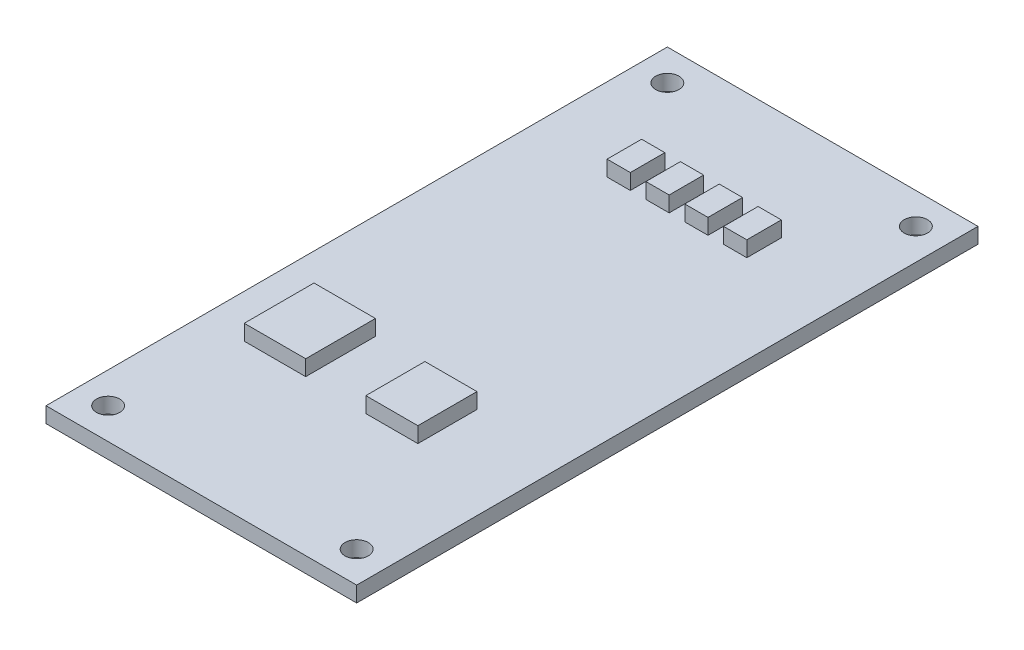
ISO-10303-21;
HEADER;
FILE_DESCRIPTION(('STEP AP214'),'2;1');
FILE_NAME('part.step','',(''),(''),'','','');
FILE_SCHEMA(('AUTOMOTIVE_DESIGN { 1 0 10303 214 1 1 1 1 }'));
ENDSEC;
DATA;
#1=APPLICATION_CONTEXT('core data for automotive mechanical design processes');
#2=APPLICATION_PROTOCOL_DEFINITION('international standard','automotive_design',2000,#1);
#3=PRODUCT_CONTEXT('',#1,'mechanical');
#4=PRODUCT('Part','Part','',(#3));
#5=PRODUCT_RELATED_PRODUCT_CATEGORY('part','',(#4));
#6=PRODUCT_DEFINITION_FORMATION('','',#4);
#7=PRODUCT_DEFINITION_CONTEXT('part definition',#1,'design');
#8=PRODUCT_DEFINITION('design','',#6,#7);
#9=PRODUCT_DEFINITION_SHAPE('','',#8);
#10=(LENGTH_UNIT() NAMED_UNIT(*) SI_UNIT(.MILLI.,.METRE.));
#11=(NAMED_UNIT(*) PLANE_ANGLE_UNIT() SI_UNIT($,.RADIAN.));
#12=(NAMED_UNIT(*) SI_UNIT($,.STERADIAN.) SOLID_ANGLE_UNIT());
#13=UNCERTAINTY_MEASURE_WITH_UNIT(LENGTH_MEASURE(1.E-05),#10,'distance_accuracy_value','');
#14=(GEOMETRIC_REPRESENTATION_CONTEXT(3) GLOBAL_UNCERTAINTY_ASSIGNED_CONTEXT((#13)) GLOBAL_UNIT_ASSIGNED_CONTEXT((#10,
#11,#12)) REPRESENTATION_CONTEXT('',''));
#15=CARTESIAN_POINT('',(0.,0.,0.));
#16=DIRECTION('',(0.,0.,1.));
#17=DIRECTION('',(1.,0.,0.));
#18=AXIS2_PLACEMENT_3D('',#15,#16,#17);
#19=CARTESIAN_POINT('',(0.,2.,0.));
#20=DIRECTION('',(0.,1.,0.));
#21=DIRECTION('',(0.,0.,1.));
#22=AXIS2_PLACEMENT_3D('',#19,#20,#21);
#23=PLANE('',#22);
#24=CARTESIAN_POINT('',(16.0000000000008,2.,36.));
#25=DIRECTION('',(0.,1.,0.));
#26=DIRECTION('',(0.,0.,1.));
#27=AXIS2_PLACEMENT_3D('',#24,#25,#26);
#28=CIRCLE('',#27,1.5);
#29=CARTESIAN_POINT('',(16.0000000000008,2.,37.5));
#30=VERTEX_POINT('',#29);
#31=EDGE_CURVE('E399',#30,#30,#28,.T.);
#32=ORIENTED_EDGE('',*,*,#31,.F.);
#33=EDGE_LOOP('',(#32));
#34=FACE_BOUND('',#33,.T.);
#35=CARTESIAN_POINT('',(-16.,2.,-36.));
#36=DIRECTION('',(0.,1.,0.));
#37=DIRECTION('',(0.,0.,1.));
#38=AXIS2_PLACEMENT_3D('',#35,#36,#37);
#39=CIRCLE('',#38,1.5);
#40=CARTESIAN_POINT('',(-16.,2.,-34.5));
#41=VERTEX_POINT('',#40);
#42=EDGE_CURVE('E411',#41,#41,#39,.T.);
#43=ORIENTED_EDGE('',*,*,#42,.F.);
#44=EDGE_LOOP('',(#43));
#45=FACE_BOUND('',#44,.T.);
#46=DIRECTION('',(0.,0.,1.));
#47=VECTOR('',#46,1.);
#48=CARTESIAN_POINT('',(-20.,2.,40.));
#49=LINE('',#48,#47);
#50=CARTESIAN_POINT('',(-20.,2.,-40.));
#51=VERTEX_POINT('',#50);
#52=CARTESIAN_POINT('',(-20.,2.,40.));
#53=VERTEX_POINT('',#52);
#54=EDGE_CURVE('E417',#51,#53,#49,.T.);
#55=ORIENTED_EDGE('',*,*,#54,.T.);
#56=DIRECTION('',(1.,0.,0.));
#57=VECTOR('',#56,1.);
#58=CARTESIAN_POINT('',(20.,2.,40.));
#59=LINE('',#58,#57);
#60=CARTESIAN_POINT('',(20.,2.,40.));
#61=VERTEX_POINT('',#60);
#62=EDGE_CURVE('E420',#53,#61,#59,.T.);
#63=ORIENTED_EDGE('',*,*,#62,.T.);
#64=DIRECTION('',(0.,0.,-1.));
#65=VECTOR('',#64,1.);
#66=CARTESIAN_POINT('',(20.,2.,40.));
#67=LINE('',#66,#65);
#68=CARTESIAN_POINT('',(20.,2.,-40.));
#69=VERTEX_POINT('',#68);
#70=EDGE_CURVE('E423',#61,#69,#67,.T.);
#71=ORIENTED_EDGE('',*,*,#70,.T.);
#72=DIRECTION('',(-1.,0.,0.));
#73=VECTOR('',#72,1.);
#74=CARTESIAN_POINT('',(20.,2.,-40.));
#75=LINE('',#74,#73);
#76=EDGE_CURVE('E425',#69,#51,#75,.T.);
#77=ORIENTED_EDGE('',*,*,#76,.T.);
#78=EDGE_LOOP('',(#55,#63,#71,#77));
#79=FACE_BOUND('',#78,.T.);
#80=CARTESIAN_POINT('',(16.,2.,-36.));
#81=DIRECTION('',(0.,1.,0.));
#82=DIRECTION('',(0.,0.,1.));
#83=AXIS2_PLACEMENT_3D('',#80,#81,#82);
#84=CIRCLE('',#83,1.5);
#85=CARTESIAN_POINT('',(16.,2.,-34.5));
#86=VERTEX_POINT('',#85);
#87=EDGE_CURVE('E405',#86,#86,#84,.T.);
#88=ORIENTED_EDGE('',*,*,#87,.F.);
#89=EDGE_LOOP('',(#88));
#90=FACE_BOUND('',#89,.T.);
#91=CARTESIAN_POINT('',(-15.9999999999992,2.,36.));
#92=DIRECTION('',(0.,1.,0.));
#93=DIRECTION('',(0.,0.,1.));
#94=AXIS2_PLACEMENT_3D('',#91,#92,#93);
#95=CIRCLE('',#94,1.5);
#96=CARTESIAN_POINT('',(-15.9999999999992,2.,37.5));
#97=VERTEX_POINT('',#96);
#98=EDGE_CURVE('E393',#97,#97,#95,.T.);
#99=ORIENTED_EDGE('',*,*,#98,.F.);
#100=EDGE_LOOP('',(#99));
#101=FACE_BOUND('',#100,.T.);
#102=DIRECTION('',(-1.,0.,0.));
#103=VECTOR('',#102,1.);
#104=CARTESIAN_POINT('',(-14.430267486052,2.,11.0632050726399));
#105=LINE('',#104,#103);
#106=CARTESIAN_POINT('',(-6.52034308629017,2.,11.0632050726399));
#107=VERTEX_POINT('',#106);
#108=CARTESIAN_POINT('',(-14.430267486052,2.,11.0632050726399));
#109=VERTEX_POINT('',#108);
#110=EDGE_CURVE('E377',#107,#109,#105,.T.);
#111=ORIENTED_EDGE('',*,*,#110,.F.);
#112=DIRECTION('',(0.,0.,-1.));
#113=VECTOR('',#112,1.);
#114=CARTESIAN_POINT('',(-6.52034308629017,2.,11.0632050726399));
#115=LINE('',#114,#113);
#116=CARTESIAN_POINT('',(-6.52034308629017,2.,20.0420381750722));
#117=VERTEX_POINT('',#116);
#118=EDGE_CURVE('E363',#117,#107,#115,.T.);
#119=ORIENTED_EDGE('',*,*,#118,.F.);
#120=DIRECTION('',(1.,0.,0.));
#121=VECTOR('',#120,1.);
#122=CARTESIAN_POINT('',(-14.430267486052,2.,20.0420381750722));
#123=LINE('',#122,#121);
#124=CARTESIAN_POINT('',(-14.430267486052,2.,20.0420381750722));
#125=VERTEX_POINT('',#124);
#126=EDGE_CURVE('E368',#125,#117,#123,.T.);
#127=ORIENTED_EDGE('',*,*,#126,.F.);
#128=DIRECTION('',(0.,0.,1.));
#129=VECTOR('',#128,1.);
#130=CARTESIAN_POINT('',(-14.430267486052,2.,11.0632050726399));
#131=LINE('',#130,#129);
#132=EDGE_CURVE('E379',#109,#125,#131,.T.);
#133=ORIENTED_EDGE('',*,*,#132,.F.);
#134=EDGE_LOOP('',(#111,#119,#127,#133));
#135=FACE_BOUND('',#134,.T.);
#136=DIRECTION('',(-1.,0.,0.));
#137=VECTOR('',#136,1.);
#138=CARTESIAN_POINT('',(1.46490476535392,2.,12.6783234692352));
#139=LINE('',#138,#137);
#140=CARTESIAN_POINT('',(8.16668323767724,2.,12.6783234692352));
#141=VERTEX_POINT('',#140);
#142=CARTESIAN_POINT('',(1.46490476535392,2.,12.6783234692352));
#143=VERTEX_POINT('',#142);
#144=EDGE_CURVE('E348',#141,#143,#139,.T.);
#145=ORIENTED_EDGE('',*,*,#144,.F.);
#146=DIRECTION('',(0.,0.,-1.));
#147=VECTOR('',#146,1.);
#148=CARTESIAN_POINT('',(8.16668323767724,2.,12.6783234692352));
#149=LINE('',#148,#147);
#150=CARTESIAN_POINT('',(8.16668323767724,2.,20.2857476810617));
#151=VERTEX_POINT('',#150);
#152=EDGE_CURVE('E334',#151,#141,#149,.T.);
#153=ORIENTED_EDGE('',*,*,#152,.F.);
#154=DIRECTION('',(1.,0.,0.));
#155=VECTOR('',#154,1.);
#156=CARTESIAN_POINT('',(1.46490476535392,2.,20.2857476810617));
#157=LINE('',#156,#155);
#158=CARTESIAN_POINT('',(1.46490476535392,2.,20.2857476810617));
#159=VERTEX_POINT('',#158);
#160=EDGE_CURVE('E339',#159,#151,#157,.T.);
#161=ORIENTED_EDGE('',*,*,#160,.F.);
#162=DIRECTION('',(0.,0.,1.));
#163=VECTOR('',#162,1.);
#164=CARTESIAN_POINT('',(1.46490476535392,2.,12.6783234692352));
#165=LINE('',#164,#163);
#166=EDGE_CURVE('E350',#143,#159,#165,.T.);
#167=ORIENTED_EDGE('',*,*,#166,.F.);
#168=EDGE_LOOP('',(#145,#153,#161,#167));
#169=FACE_BOUND('',#168,.T.);
#170=DIRECTION('',(-1.,0.,0.));
#171=VECTOR('',#170,1.);
#172=CARTESIAN_POINT('',(-9.37411141019778,2.,-26.0600449276688));
#173=LINE('',#172,#171);
#174=CARTESIAN_POINT('',(-6.38247865006747,2.,-26.0600449276688));
#175=VERTEX_POINT('',#174);
#176=CARTESIAN_POINT('',(-9.37411141019778,2.,-26.0600449276688));
#177=VERTEX_POINT('',#176);
#178=EDGE_CURVE('E319',#175,#177,#173,.T.);
#179=ORIENTED_EDGE('',*,*,#178,.F.);
#180=DIRECTION('',(0.,0.,-1.));
#181=VECTOR('',#180,1.);
#182=CARTESIAN_POINT('',(-6.38247865006747,2.,-26.0600449276688));
#183=LINE('',#182,#181);
#184=CARTESIAN_POINT('',(-6.38247865006747,2.,-21.6175192445576));
#185=VERTEX_POINT('',#184);
#186=EDGE_CURVE('E305',#185,#175,#183,.T.);
#187=ORIENTED_EDGE('',*,*,#186,.F.);
#188=DIRECTION('',(1.,0.,0.));
#189=VECTOR('',#188,1.);
#190=CARTESIAN_POINT('',(-9.37411141019778,2.,-21.6175192445576));
#191=LINE('',#190,#189);
#192=CARTESIAN_POINT('',(-9.37411141019778,2.,-21.6175192445576));
#193=VERTEX_POINT('',#192);
#194=EDGE_CURVE('E310',#193,#185,#191,.T.);
#195=ORIENTED_EDGE('',*,*,#194,.F.);
#196=DIRECTION('',(0.,0.,1.));
#197=VECTOR('',#196,1.);
#198=CARTESIAN_POINT('',(-9.37411141019778,2.,-26.0600449276688));
#199=LINE('',#198,#197);
#200=EDGE_CURVE('E321',#177,#193,#199,.T.);
#201=ORIENTED_EDGE('',*,*,#200,.F.);
#202=EDGE_LOOP('',(#179,#187,#195,#201));
#203=FACE_BOUND('',#202,.T.);
#204=DIRECTION('',(-1.,0.,0.));
#205=VECTOR('',#204,1.);
#206=CARTESIAN_POINT('',(-4.37411141019778,2.,-26.0600449276688));
#207=LINE('',#206,#205);
#208=CARTESIAN_POINT('',(-1.38247865006747,2.,-26.0600449276688));
#209=VERTEX_POINT('',#208);
#210=CARTESIAN_POINT('',(-4.37411141019778,2.,-26.0600449276688));
#211=VERTEX_POINT('',#210);
#212=EDGE_CURVE('E290',#209,#211,#207,.T.);
#213=ORIENTED_EDGE('',*,*,#212,.F.);
#214=DIRECTION('',(0.,0.,-1.));
#215=VECTOR('',#214,1.);
#216=CARTESIAN_POINT('',(-1.38247865006747,2.,-26.0600449276688));
#217=LINE('',#216,#215);
#218=CARTESIAN_POINT('',(-1.38247865006747,2.,-21.6175192445576));
#219=VERTEX_POINT('',#218);
#220=EDGE_CURVE('E276',#219,#209,#217,.T.);
#221=ORIENTED_EDGE('',*,*,#220,.F.);
#222=DIRECTION('',(1.,0.,0.));
#223=VECTOR('',#222,1.);
#224=CARTESIAN_POINT('',(-4.37411141019778,2.,-21.6175192445576));
#225=LINE('',#224,#223);
#226=CARTESIAN_POINT('',(-4.37411141019778,2.,-21.6175192445576));
#227=VERTEX_POINT('',#226);
#228=EDGE_CURVE('E281',#227,#219,#225,.T.);
#229=ORIENTED_EDGE('',*,*,#228,.F.);
#230=DIRECTION('',(0.,0.,1.));
#231=VECTOR('',#230,1.);
#232=CARTESIAN_POINT('',(-4.37411141019778,2.,-26.0600449276688));
#233=LINE('',#232,#231);
#234=EDGE_CURVE('E292',#211,#227,#233,.T.);
#235=ORIENTED_EDGE('',*,*,#234,.F.);
#236=EDGE_LOOP('',(#213,#221,#229,#235));
#237=FACE_BOUND('',#236,.T.);
#238=DIRECTION('',(-1.,0.,0.));
#239=VECTOR('',#238,1.);
#240=CARTESIAN_POINT('',(0.625888589802217,2.,-26.0600449276688));
#241=LINE('',#240,#239);
#242=CARTESIAN_POINT('',(3.61752134993253,2.,-26.0600449276688));
#243=VERTEX_POINT('',#242);
#244=CARTESIAN_POINT('',(0.625888589802217,2.,-26.0600449276688));
#245=VERTEX_POINT('',#244);
#246=EDGE_CURVE('E248',#243,#245,#241,.T.);
#247=ORIENTED_EDGE('',*,*,#246,.F.);
#248=DIRECTION('',(0.,0.,-1.));
#249=VECTOR('',#248,1.);
#250=CARTESIAN_POINT('',(3.61752134993253,2.,-26.0600449276688));
#251=LINE('',#250,#249);
#252=CARTESIAN_POINT('',(3.61752134993253,2.,-21.6175192445576));
#253=VERTEX_POINT('',#252);
#254=EDGE_CURVE('E245',#253,#243,#251,.T.);
#255=ORIENTED_EDGE('',*,*,#254,.F.);
#256=DIRECTION('',(1.,0.,0.));
#257=VECTOR('',#256,1.);
#258=CARTESIAN_POINT('',(0.625888589802217,2.,-21.6175192445576));
#259=LINE('',#258,#257);
#260=CARTESIAN_POINT('',(0.625888589802217,2.,-21.6175192445576));
#261=VERTEX_POINT('',#260);
#262=EDGE_CURVE('E257',#261,#253,#259,.T.);
#263=ORIENTED_EDGE('',*,*,#262,.F.);
#264=DIRECTION('',(0.,0.,1.));
#265=VECTOR('',#264,1.);
#266=CARTESIAN_POINT('',(0.625888589802217,2.,-26.0600449276688));
#267=LINE('',#266,#265);
#268=EDGE_CURVE('E265',#245,#261,#267,.T.);
#269=ORIENTED_EDGE('',*,*,#268,.F.);
#270=EDGE_LOOP('',(#247,#255,#263,#269));
#271=FACE_BOUND('',#270,.T.);
#272=DIRECTION('',(-1.,0.,0.));
#273=VECTOR('',#272,1.);
#274=CARTESIAN_POINT('',(5.62588858980222,2.,-26.0600449276688));
#275=LINE('',#274,#273);
#276=CARTESIAN_POINT('',(8.61752134993253,2.,-26.0600449276688));
#277=VERTEX_POINT('',#276);
#278=CARTESIAN_POINT('',(5.62588858980222,2.,-26.0600449276688));
#279=VERTEX_POINT('',#278);
#280=EDGE_CURVE('E860',#277,#279,#275,.T.);
#281=ORIENTED_EDGE('',*,*,#280,.F.);
#282=DIRECTION('',(0.,0.,-1.));
#283=VECTOR('',#282,1.);
#284=CARTESIAN_POINT('',(8.61752134993253,2.,-26.0600449276688));
#285=LINE('',#284,#283);
#286=CARTESIAN_POINT('',(8.61752134993253,2.,-21.6175192445576));
#287=VERTEX_POINT('',#286);
#288=EDGE_CURVE('E243',#287,#277,#285,.T.);
#289=ORIENTED_EDGE('',*,*,#288,.F.);
#290=DIRECTION('',(1.,0.,0.));
#291=VECTOR('',#290,1.);
#292=CARTESIAN_POINT('',(5.62588858980222,2.,-21.6175192445576));
#293=LINE('',#292,#291);
#294=CARTESIAN_POINT('',(5.62588858980222,2.,-21.6175192445576));
#295=VERTEX_POINT('',#294);
#296=EDGE_CURVE('E239',#295,#287,#293,.T.);
#297=ORIENTED_EDGE('',*,*,#296,.F.);
#298=DIRECTION('',(0.,0.,1.));
#299=VECTOR('',#298,1.);
#300=CARTESIAN_POINT('',(5.62588858980222,2.,-26.0600449276688));
#301=LINE('',#300,#299);
#302=EDGE_CURVE('E857',#279,#295,#301,.T.);
#303=ORIENTED_EDGE('',*,*,#302,.F.);
#304=EDGE_LOOP('',(#281,#289,#297,#303));
#305=FACE_BOUND('',#304,.T.);
#306=ADVANCED_FACE('F34',(#34,#45,#79,#90,#101,#135,#169,#203,#237,#271,#305),#23,.T.);
#307=CARTESIAN_POINT('',(0.,0.,0.));
#308=DIRECTION('',(0.,1.,0.));
#309=DIRECTION('',(0.,0.,1.));
#310=AXIS2_PLACEMENT_3D('',#307,#308,#309);
#311=PLANE('',#310);
#312=DIRECTION('',(0.,0.,1.));
#313=VECTOR('',#312,1.);
#314=CARTESIAN_POINT('',(-20.,0.,40.));
#315=LINE('',#314,#313);
#316=CARTESIAN_POINT('',(-20.,0.,-40.));
#317=VERTEX_POINT('',#316);
#318=CARTESIAN_POINT('',(-20.,0.,40.));
#319=VERTEX_POINT('',#318);
#320=EDGE_CURVE('E414',#317,#319,#315,.T.);
#321=ORIENTED_EDGE('',*,*,#320,.F.);
#322=DIRECTION('',(-1.,0.,0.));
#323=VECTOR('',#322,1.);
#324=CARTESIAN_POINT('',(20.,0.,-40.));
#325=LINE('',#324,#323);
#326=CARTESIAN_POINT('',(20.,0.,-40.));
#327=VERTEX_POINT('',#326);
#328=EDGE_CURVE('E421',#327,#317,#325,.T.);
#329=ORIENTED_EDGE('',*,*,#328,.F.);
#330=DIRECTION('',(0.,0.,-1.));
#331=VECTOR('',#330,1.);
#332=CARTESIAN_POINT('',(20.,0.,40.));
#333=LINE('',#332,#331);
#334=CARTESIAN_POINT('',(20.,0.,40.));
#335=VERTEX_POINT('',#334);
#336=EDGE_CURVE('E432',#335,#327,#333,.T.);
#337=ORIENTED_EDGE('',*,*,#336,.F.);
#338=DIRECTION('',(1.,0.,0.));
#339=VECTOR('',#338,1.);
#340=CARTESIAN_POINT('',(20.,0.,40.));
#341=LINE('',#340,#339);
#342=EDGE_CURVE('E430',#319,#335,#341,.T.);
#343=ORIENTED_EDGE('',*,*,#342,.F.);
#344=EDGE_LOOP('',(#321,#329,#337,#343));
#345=FACE_BOUND('',#344,.T.);
#346=CARTESIAN_POINT('',(-16.,0.,-36.));
#347=DIRECTION('',(0.,1.,0.));
#348=DIRECTION('',(0.,0.,1.));
#349=AXIS2_PLACEMENT_3D('',#346,#347,#348);
#350=CIRCLE('',#349,1.5);
#351=CARTESIAN_POINT('',(-16.,0.,-34.5));
#352=VERTEX_POINT('',#351);
#353=EDGE_CURVE('E408',#352,#352,#350,.T.);
#354=ORIENTED_EDGE('',*,*,#353,.T.);
#355=EDGE_LOOP('',(#354));
#356=FACE_BOUND('',#355,.T.);
#357=CARTESIAN_POINT('',(16.,0.,-36.));
#358=DIRECTION('',(0.,1.,0.));
#359=DIRECTION('',(0.,0.,1.));
#360=AXIS2_PLACEMENT_3D('',#357,#358,#359);
#361=CIRCLE('',#360,1.5);
#362=CARTESIAN_POINT('',(16.,0.,-34.5));
#363=VERTEX_POINT('',#362);
#364=EDGE_CURVE('E402',#363,#363,#361,.T.);
#365=ORIENTED_EDGE('',*,*,#364,.T.);
#366=EDGE_LOOP('',(#365));
#367=FACE_BOUND('',#366,.T.);
#368=CARTESIAN_POINT('',(16.0000000000008,0.,36.));
#369=DIRECTION('',(0.,1.,0.));
#370=DIRECTION('',(0.,0.,1.));
#371=AXIS2_PLACEMENT_3D('',#368,#369,#370);
#372=CIRCLE('',#371,1.5);
#373=CARTESIAN_POINT('',(16.0000000000008,0.,37.5));
#374=VERTEX_POINT('',#373);
#375=EDGE_CURVE('E396',#374,#374,#372,.T.);
#376=ORIENTED_EDGE('',*,*,#375,.T.);
#377=EDGE_LOOP('',(#376));
#378=FACE_BOUND('',#377,.T.);
#379=CARTESIAN_POINT('',(-15.9999999999992,0.,36.));
#380=DIRECTION('',(0.,1.,0.));
#381=DIRECTION('',(0.,0.,1.));
#382=AXIS2_PLACEMENT_3D('',#379,#380,#381);
#383=CIRCLE('',#382,1.5);
#384=CARTESIAN_POINT('',(-15.9999999999992,0.,37.5));
#385=VERTEX_POINT('',#384);
#386=EDGE_CURVE('E392',#385,#385,#383,.T.);
#387=ORIENTED_EDGE('',*,*,#386,.T.);
#388=EDGE_LOOP('',(#387));
#389=FACE_BOUND('',#388,.T.);
#390=ADVANCED_FACE('F450',(#345,#356,#367,#378,#389),#311,.F.);
#391=CARTESIAN_POINT('',(-20.,2.,40.));
#392=DIRECTION('',(1.,0.,0.));
#393=DIRECTION('',(0.,0.,-1.));
#394=AXIS2_PLACEMENT_3D('',#391,#392,#393);
#395=PLANE('',#394);
#396=ORIENTED_EDGE('',*,*,#320,.T.);
#397=DIRECTION('',(0.,-1.,0.));
#398=VECTOR('',#397,1.);
#399=CARTESIAN_POINT('',(-20.,2.,40.));
#400=LINE('',#399,#398);
#401=EDGE_CURVE('E11',#53,#319,#400,.T.);
#402=ORIENTED_EDGE('',*,*,#401,.F.);
#403=ORIENTED_EDGE('',*,*,#54,.F.);
#404=DIRECTION('',(0.,-1.,0.));
#405=VECTOR('',#404,1.);
#406=CARTESIAN_POINT('',(-20.,2.,-40.));
#407=LINE('',#406,#405);
#408=EDGE_CURVE('E427',#51,#317,#407,.T.);
#409=ORIENTED_EDGE('',*,*,#408,.T.);
#410=EDGE_LOOP('',(#396,#402,#403,#409));
#411=FACE_BOUND('',#410,.T.);
#412=ADVANCED_FACE('F36',(#411),#395,.F.);
#413=CARTESIAN_POINT('',(20.,2.,40.));
#414=DIRECTION('',(0.,0.,-1.));
#415=DIRECTION('',(-1.,0.,0.));
#416=AXIS2_PLACEMENT_3D('',#413,#414,#415);
#417=PLANE('',#416);
#418=ORIENTED_EDGE('',*,*,#342,.T.);
#419=DIRECTION('',(0.,-1.,0.));
#420=VECTOR('',#419,1.);
#421=CARTESIAN_POINT('',(20.,2.,40.));
#422=LINE('',#421,#420);
#423=EDGE_CURVE('E42',#61,#335,#422,.T.);
#424=ORIENTED_EDGE('',*,*,#423,.F.);
#425=ORIENTED_EDGE('',*,*,#62,.F.);
#426=ORIENTED_EDGE('',*,*,#401,.T.);
#427=EDGE_LOOP('',(#418,#424,#425,#426));
#428=FACE_BOUND('',#427,.T.);
#429=ADVANCED_FACE('F461',(#428),#417,.F.);
#430=CARTESIAN_POINT('',(20.,2.,40.));
#431=DIRECTION('',(-1.,0.,0.));
#432=DIRECTION('',(0.,0.,1.));
#433=AXIS2_PLACEMENT_3D('',#430,#431,#432);
#434=PLANE('',#433);
#435=ORIENTED_EDGE('',*,*,#336,.T.);
#436=DIRECTION('',(0.,-1.,0.));
#437=VECTOR('',#436,1.);
#438=CARTESIAN_POINT('',(20.,2.,-40.));
#439=LINE('',#438,#437);
#440=EDGE_CURVE('E437',#69,#327,#439,.T.);
#441=ORIENTED_EDGE('',*,*,#440,.F.);
#442=ORIENTED_EDGE('',*,*,#70,.F.);
#443=ORIENTED_EDGE('',*,*,#423,.T.);
#444=EDGE_LOOP('',(#435,#441,#442,#443));
#445=FACE_BOUND('',#444,.T.);
#446=ADVANCED_FACE('F444',(#445),#434,.F.);
#447=CARTESIAN_POINT('',(20.,2.,-40.));
#448=DIRECTION('',(0.,0.,1.));
#449=DIRECTION('',(1.,0.,0.));
#450=AXIS2_PLACEMENT_3D('',#447,#448,#449);
#451=PLANE('',#450);
#452=ORIENTED_EDGE('',*,*,#328,.T.);
#453=ORIENTED_EDGE('',*,*,#408,.F.);
#454=ORIENTED_EDGE('',*,*,#76,.F.);
#455=ORIENTED_EDGE('',*,*,#440,.T.);
#456=EDGE_LOOP('',(#452,#453,#454,#455));
#457=FACE_BOUND('',#456,.T.);
#458=ADVANCED_FACE('F454',(#457),#451,.F.);
#459=CARTESIAN_POINT('',(-16.,2.,-36.));
#460=DIRECTION('',(0.,-1.,0.));
#461=DIRECTION('',(0.,0.,-1.));
#462=AXIS2_PLACEMENT_3D('',#459,#460,#461);
#463=CYLINDRICAL_SURFACE('',#462,1.5);
#464=ORIENTED_EDGE('',*,*,#42,.T.);
#465=EDGE_LOOP('',(#464));
#466=FACE_BOUND('',#465,.T.);
#467=ORIENTED_EDGE('',*,*,#353,.F.);
#468=EDGE_LOOP('',(#467));
#469=FACE_BOUND('',#468,.T.);
#470=ADVANCED_FACE('F478',(#466,#469),#463,.F.);
#471=CARTESIAN_POINT('',(16.,2.,-36.));
#472=DIRECTION('',(0.,-1.,0.));
#473=DIRECTION('',(0.,0.,-1.));
#474=AXIS2_PLACEMENT_3D('',#471,#472,#473);
#475=CYLINDRICAL_SURFACE('',#474,1.5);
#476=ORIENTED_EDGE('',*,*,#87,.T.);
#477=EDGE_LOOP('',(#476));
#478=FACE_BOUND('',#477,.T.);
#479=ORIENTED_EDGE('',*,*,#364,.F.);
#480=EDGE_LOOP('',(#479));
#481=FACE_BOUND('',#480,.T.);
#482=ADVANCED_FACE('F485',(#478,#481),#475,.F.);
#483=CARTESIAN_POINT('',(16.0000000000008,2.,36.));
#484=DIRECTION('',(0.,-1.,0.));
#485=DIRECTION('',(0.,0.,-1.));
#486=AXIS2_PLACEMENT_3D('',#483,#484,#485);
#487=CYLINDRICAL_SURFACE('',#486,1.5);
#488=ORIENTED_EDGE('',*,*,#31,.T.);
#489=EDGE_LOOP('',(#488));
#490=FACE_BOUND('',#489,.T.);
#491=ORIENTED_EDGE('',*,*,#375,.F.);
#492=EDGE_LOOP('',(#491));
#493=FACE_BOUND('',#492,.T.);
#494=ADVANCED_FACE('F490',(#490,#493),#487,.F.);
#495=CARTESIAN_POINT('',(-15.9999999999992,2.,36.));
#496=DIRECTION('',(0.,-1.,0.));
#497=DIRECTION('',(0.,0.,-1.));
#498=AXIS2_PLACEMENT_3D('',#495,#496,#497);
#499=CYLINDRICAL_SURFACE('',#498,1.5);
#500=ORIENTED_EDGE('',*,*,#98,.T.);
#501=EDGE_LOOP('',(#500));
#502=FACE_BOUND('',#501,.T.);
#503=ORIENTED_EDGE('',*,*,#386,.F.);
#504=EDGE_LOOP('',(#503));
#505=FACE_BOUND('',#504,.T.);
#506=ADVANCED_FACE('F502',(#502,#505),#499,.F.);
#507=CARTESIAN_POINT('',(-6.52034308629017,4.,11.0632050726399));
#508=DIRECTION('',(-1.,0.,0.));
#509=DIRECTION('',(0.,0.,1.));
#510=AXIS2_PLACEMENT_3D('',#507,#508,#509);
#511=PLANE('',#510);
#512=ORIENTED_EDGE('',*,*,#118,.T.);
#513=DIRECTION('',(0.,-1.,0.));
#514=VECTOR('',#513,1.);
#515=CARTESIAN_POINT('',(-6.52034308629017,4.,11.0632050726399));
#516=LINE('',#515,#514);
#517=CARTESIAN_POINT('',(-6.52034308629017,4.,11.0632050726399));
#518=VERTEX_POINT('',#517);
#519=EDGE_CURVE('E390',#518,#107,#516,.T.);
#520=ORIENTED_EDGE('',*,*,#519,.F.);
#521=DIRECTION('',(0.,0.,-1.));
#522=VECTOR('',#521,1.);
#523=CARTESIAN_POINT('',(-6.52034308629017,4.,11.0632050726399));
#524=LINE('',#523,#522);
#525=CARTESIAN_POINT('',(-6.52034308629017,4.,20.0420381750722));
#526=VERTEX_POINT('',#525);
#527=EDGE_CURVE('E364',#526,#518,#524,.T.);
#528=ORIENTED_EDGE('',*,*,#527,.F.);
#529=DIRECTION('',(0.,-1.,0.));
#530=VECTOR('',#529,1.);
#531=CARTESIAN_POINT('',(-6.52034308629017,4.,20.0420381750722));
#532=LINE('',#531,#530);
#533=EDGE_CURVE('E374',#526,#117,#532,.T.);
#534=ORIENTED_EDGE('',*,*,#533,.T.);
#535=EDGE_LOOP('',(#512,#520,#528,#534));
#536=FACE_BOUND('',#535,.T.);
#537=ADVANCED_FACE('F504',(#536),#511,.F.);
#538=CARTESIAN_POINT('',(-14.430267486052,4.,11.0632050726399));
#539=DIRECTION('',(0.,0.,1.));
#540=DIRECTION('',(1.,0.,0.));
#541=AXIS2_PLACEMENT_3D('',#538,#539,#540);
#542=PLANE('',#541);
#543=ORIENTED_EDGE('',*,*,#110,.T.);
#544=DIRECTION('',(0.,-1.,0.));
#545=VECTOR('',#544,1.);
#546=CARTESIAN_POINT('',(-14.430267486052,4.,11.0632050726399));
#547=LINE('',#546,#545);
#548=CARTESIAN_POINT('',(-14.430267486052,4.,11.0632050726399));
#549=VERTEX_POINT('',#548);
#550=EDGE_CURVE('E387',#549,#109,#547,.T.);
#551=ORIENTED_EDGE('',*,*,#550,.F.);
#552=DIRECTION('',(-1.,0.,0.));
#553=VECTOR('',#552,1.);
#554=CARTESIAN_POINT('',(-14.430267486052,4.,11.0632050726399));
#555=LINE('',#554,#553);
#556=EDGE_CURVE('E367',#518,#549,#555,.T.);
#557=ORIENTED_EDGE('',*,*,#556,.F.);
#558=ORIENTED_EDGE('',*,*,#519,.T.);
#559=EDGE_LOOP('',(#543,#551,#557,#558));
#560=FACE_BOUND('',#559,.T.);
#561=ADVANCED_FACE('F511',(#560),#542,.F.);
#562=CARTESIAN_POINT('',(-14.430267486052,4.,11.0632050726399));
#563=DIRECTION('',(1.,0.,0.));
#564=DIRECTION('',(0.,0.,-1.));
#565=AXIS2_PLACEMENT_3D('',#562,#563,#564);
#566=PLANE('',#565);
#567=ORIENTED_EDGE('',*,*,#132,.T.);
#568=DIRECTION('',(0.,-1.,0.));
#569=VECTOR('',#568,1.);
#570=CARTESIAN_POINT('',(-14.430267486052,4.,20.0420381750722));
#571=LINE('',#570,#569);
#572=CARTESIAN_POINT('',(-14.430267486052,4.,20.0420381750722));
#573=VERTEX_POINT('',#572);
#574=EDGE_CURVE('E385',#573,#125,#571,.T.);
#575=ORIENTED_EDGE('',*,*,#574,.F.);
#576=DIRECTION('',(0.,0.,1.));
#577=VECTOR('',#576,1.);
#578=CARTESIAN_POINT('',(-14.430267486052,4.,11.0632050726399));
#579=LINE('',#578,#577);
#580=EDGE_CURVE('E370',#549,#573,#579,.T.);
#581=ORIENTED_EDGE('',*,*,#580,.F.);
#582=ORIENTED_EDGE('',*,*,#550,.T.);
#583=EDGE_LOOP('',(#567,#575,#581,#582));
#584=FACE_BOUND('',#583,.T.);
#585=ADVANCED_FACE('F519',(#584),#566,.F.);
#586=CARTESIAN_POINT('',(-14.430267486052,4.,20.0420381750722));
#587=DIRECTION('',(0.,0.,-1.));
#588=DIRECTION('',(-1.,0.,0.));
#589=AXIS2_PLACEMENT_3D('',#586,#587,#588);
#590=PLANE('',#589);
#591=ORIENTED_EDGE('',*,*,#126,.T.);
#592=ORIENTED_EDGE('',*,*,#533,.F.);
#593=DIRECTION('',(1.,0.,0.));
#594=VECTOR('',#593,1.);
#595=CARTESIAN_POINT('',(-14.430267486052,4.,20.0420381750722));
#596=LINE('',#595,#594);
#597=EDGE_CURVE('E372',#573,#526,#596,.T.);
#598=ORIENTED_EDGE('',*,*,#597,.F.);
#599=ORIENTED_EDGE('',*,*,#574,.T.);
#600=EDGE_LOOP('',(#591,#592,#598,#599));
#601=FACE_BOUND('',#600,.T.);
#602=ADVANCED_FACE('F523',(#601),#590,.F.);
#603=CARTESIAN_POINT('',(0.,4.,0.));
#604=DIRECTION('',(0.,1.,0.));
#605=DIRECTION('',(0.,0.,1.));
#606=AXIS2_PLACEMENT_3D('',#603,#604,#605);
#607=PLANE('',#606);
#608=ORIENTED_EDGE('',*,*,#527,.T.);
#609=ORIENTED_EDGE('',*,*,#556,.T.);
#610=ORIENTED_EDGE('',*,*,#580,.T.);
#611=ORIENTED_EDGE('',*,*,#597,.T.);
#612=EDGE_LOOP('',(#608,#609,#610,#611));
#613=FACE_BOUND('',#612,.T.);
#614=ADVANCED_FACE('F527',(#613),#607,.T.);
#615=CARTESIAN_POINT('',(8.16668323767724,4.,12.6783234692352));
#616=DIRECTION('',(-1.,0.,0.));
#617=DIRECTION('',(0.,0.,1.));
#618=AXIS2_PLACEMENT_3D('',#615,#616,#617);
#619=PLANE('',#618);
#620=ORIENTED_EDGE('',*,*,#152,.T.);
#621=DIRECTION('',(0.,-1.,0.));
#622=VECTOR('',#621,1.);
#623=CARTESIAN_POINT('',(8.16668323767724,4.,12.6783234692352));
#624=LINE('',#623,#622);
#625=CARTESIAN_POINT('',(8.16668323767724,4.,12.6783234692352));
#626=VERTEX_POINT('',#625);
#627=EDGE_CURVE('E361',#626,#141,#624,.T.);
#628=ORIENTED_EDGE('',*,*,#627,.F.);
#629=DIRECTION('',(0.,0.,-1.));
#630=VECTOR('',#629,1.);
#631=CARTESIAN_POINT('',(8.16668323767724,4.,12.6783234692352));
#632=LINE('',#631,#630);
#633=CARTESIAN_POINT('',(8.16668323767724,4.,20.2857476810617));
#634=VERTEX_POINT('',#633);
#635=EDGE_CURVE('E335',#634,#626,#632,.T.);
#636=ORIENTED_EDGE('',*,*,#635,.F.);
#637=DIRECTION('',(0.,-1.,0.));
#638=VECTOR('',#637,1.);
#639=CARTESIAN_POINT('',(8.16668323767724,4.,20.2857476810617));
#640=LINE('',#639,#638);
#641=EDGE_CURVE('E345',#634,#151,#640,.T.);
#642=ORIENTED_EDGE('',*,*,#641,.T.);
#643=EDGE_LOOP('',(#620,#628,#636,#642));
#644=FACE_BOUND('',#643,.T.);
#645=ADVANCED_FACE('F531',(#644),#619,.F.);
#646=CARTESIAN_POINT('',(1.46490476535392,4.,12.6783234692352));
#647=DIRECTION('',(0.,0.,1.));
#648=DIRECTION('',(1.,0.,0.));
#649=AXIS2_PLACEMENT_3D('',#646,#647,#648);
#650=PLANE('',#649);
#651=ORIENTED_EDGE('',*,*,#144,.T.);
#652=DIRECTION('',(0.,-1.,0.));
#653=VECTOR('',#652,1.);
#654=CARTESIAN_POINT('',(1.46490476535392,4.,12.6783234692352));
#655=LINE('',#654,#653);
#656=CARTESIAN_POINT('',(1.46490476535392,4.,12.6783234692352));
#657=VERTEX_POINT('',#656);
#658=EDGE_CURVE('E358',#657,#143,#655,.T.);
#659=ORIENTED_EDGE('',*,*,#658,.F.);
#660=DIRECTION('',(-1.,0.,0.));
#661=VECTOR('',#660,1.);
#662=CARTESIAN_POINT('',(1.46490476535392,4.,12.6783234692352));
#663=LINE('',#662,#661);
#664=EDGE_CURVE('E338',#626,#657,#663,.T.);
#665=ORIENTED_EDGE('',*,*,#664,.F.);
#666=ORIENTED_EDGE('',*,*,#627,.T.);
#667=EDGE_LOOP('',(#651,#659,#665,#666));
#668=FACE_BOUND('',#667,.T.);
#669=ADVANCED_FACE('F535',(#668),#650,.F.);
#670=CARTESIAN_POINT('',(1.46490476535392,4.,12.6783234692352));
#671=DIRECTION('',(1.,0.,0.));
#672=DIRECTION('',(0.,0.,-1.));
#673=AXIS2_PLACEMENT_3D('',#670,#671,#672);
#674=PLANE('',#673);
#675=ORIENTED_EDGE('',*,*,#166,.T.);
#676=DIRECTION('',(0.,-1.,0.));
#677=VECTOR('',#676,1.);
#678=CARTESIAN_POINT('',(1.46490476535392,4.,20.2857476810617));
#679=LINE('',#678,#677);
#680=CARTESIAN_POINT('',(1.46490476535392,4.,20.2857476810617));
#681=VERTEX_POINT('',#680);
#682=EDGE_CURVE('E356',#681,#159,#679,.T.);
#683=ORIENTED_EDGE('',*,*,#682,.F.);
#684=DIRECTION('',(0.,0.,1.));
#685=VECTOR('',#684,1.);
#686=CARTESIAN_POINT('',(1.46490476535392,4.,12.6783234692352));
#687=LINE('',#686,#685);
#688=EDGE_CURVE('E341',#657,#681,#687,.T.);
#689=ORIENTED_EDGE('',*,*,#688,.F.);
#690=ORIENTED_EDGE('',*,*,#658,.T.);
#691=EDGE_LOOP('',(#675,#683,#689,#690));
#692=FACE_BOUND('',#691,.T.);
#693=ADVANCED_FACE('F539',(#692),#674,.F.);
#694=CARTESIAN_POINT('',(1.46490476535392,4.,20.2857476810617));
#695=DIRECTION('',(0.,0.,-1.));
#696=DIRECTION('',(-1.,0.,0.));
#697=AXIS2_PLACEMENT_3D('',#694,#695,#696);
#698=PLANE('',#697);
#699=ORIENTED_EDGE('',*,*,#160,.T.);
#700=ORIENTED_EDGE('',*,*,#641,.F.);
#701=DIRECTION('',(1.,0.,0.));
#702=VECTOR('',#701,1.);
#703=CARTESIAN_POINT('',(1.46490476535392,4.,20.2857476810617));
#704=LINE('',#703,#702);
#705=EDGE_CURVE('E343',#681,#634,#704,.T.);
#706=ORIENTED_EDGE('',*,*,#705,.F.);
#707=ORIENTED_EDGE('',*,*,#682,.T.);
#708=EDGE_LOOP('',(#699,#700,#706,#707));
#709=FACE_BOUND('',#708,.T.);
#710=ADVANCED_FACE('F543',(#709),#698,.F.);
#711=CARTESIAN_POINT('',(0.,4.,0.));
#712=DIRECTION('',(0.,1.,0.));
#713=DIRECTION('',(0.,0.,1.));
#714=AXIS2_PLACEMENT_3D('',#711,#712,#713);
#715=PLANE('',#714);
#716=ORIENTED_EDGE('',*,*,#635,.T.);
#717=ORIENTED_EDGE('',*,*,#664,.T.);
#718=ORIENTED_EDGE('',*,*,#688,.T.);
#719=ORIENTED_EDGE('',*,*,#705,.T.);
#720=EDGE_LOOP('',(#716,#717,#718,#719));
#721=FACE_BOUND('',#720,.T.);
#722=ADVANCED_FACE('F547',(#721),#715,.T.);
#723=CARTESIAN_POINT('',(-6.38247865006747,4.,-26.0600449276688));
#724=DIRECTION('',(-1.,0.,0.));
#725=DIRECTION('',(0.,0.,1.));
#726=AXIS2_PLACEMENT_3D('',#723,#724,#725);
#727=PLANE('',#726);
#728=ORIENTED_EDGE('',*,*,#186,.T.);
#729=DIRECTION('',(0.,-1.,0.));
#730=VECTOR('',#729,1.);
#731=CARTESIAN_POINT('',(-6.38247865006747,4.,-26.0600449276688));
#732=LINE('',#731,#730);
#733=CARTESIAN_POINT('',(-6.38247865006747,4.,-26.0600449276688));
#734=VERTEX_POINT('',#733);
#735=EDGE_CURVE('E332',#734,#175,#732,.T.);
#736=ORIENTED_EDGE('',*,*,#735,.F.);
#737=DIRECTION('',(0.,0.,-1.));
#738=VECTOR('',#737,1.);
#739=CARTESIAN_POINT('',(-6.38247865006747,4.,-26.0600449276688));
#740=LINE('',#739,#738);
#741=CARTESIAN_POINT('',(-6.38247865006747,4.,-21.6175192445576));
#742=VERTEX_POINT('',#741);
#743=EDGE_CURVE('E306',#742,#734,#740,.T.);
#744=ORIENTED_EDGE('',*,*,#743,.F.);
#745=DIRECTION('',(0.,-1.,0.));
#746=VECTOR('',#745,1.);
#747=CARTESIAN_POINT('',(-6.38247865006747,4.,-21.6175192445576));
#748=LINE('',#747,#746);
#749=EDGE_CURVE('E316',#742,#185,#748,.T.);
#750=ORIENTED_EDGE('',*,*,#749,.T.);
#751=EDGE_LOOP('',(#728,#736,#744,#750));
#752=FACE_BOUND('',#751,.T.);
#753=ADVANCED_FACE('F551',(#752),#727,.F.);
#754=CARTESIAN_POINT('',(-9.37411141019778,4.,-26.0600449276688));
#755=DIRECTION('',(0.,0.,1.));
#756=DIRECTION('',(1.,0.,0.));
#757=AXIS2_PLACEMENT_3D('',#754,#755,#756);
#758=PLANE('',#757);
#759=ORIENTED_EDGE('',*,*,#178,.T.);
#760=DIRECTION('',(0.,-1.,0.));
#761=VECTOR('',#760,1.);
#762=CARTESIAN_POINT('',(-9.37411141019778,4.,-26.0600449276688));
#763=LINE('',#762,#761);
#764=CARTESIAN_POINT('',(-9.37411141019778,4.,-26.0600449276688));
#765=VERTEX_POINT('',#764);
#766=EDGE_CURVE('E329',#765,#177,#763,.T.);
#767=ORIENTED_EDGE('',*,*,#766,.F.);
#768=DIRECTION('',(-1.,0.,0.));
#769=VECTOR('',#768,1.);
#770=CARTESIAN_POINT('',(-9.37411141019778,4.,-26.0600449276688));
#771=LINE('',#770,#769);
#772=EDGE_CURVE('E309',#734,#765,#771,.T.);
#773=ORIENTED_EDGE('',*,*,#772,.F.);
#774=ORIENTED_EDGE('',*,*,#735,.T.);
#775=EDGE_LOOP('',(#759,#767,#773,#774));
#776=FACE_BOUND('',#775,.T.);
#777=ADVANCED_FACE('F555',(#776),#758,.F.);
#778=CARTESIAN_POINT('',(-9.37411141019778,4.,-26.0600449276688));
#779=DIRECTION('',(1.,0.,0.));
#780=DIRECTION('',(0.,0.,-1.));
#781=AXIS2_PLACEMENT_3D('',#778,#779,#780);
#782=PLANE('',#781);
#783=ORIENTED_EDGE('',*,*,#200,.T.);
#784=DIRECTION('',(0.,-1.,0.));
#785=VECTOR('',#784,1.);
#786=CARTESIAN_POINT('',(-9.37411141019778,4.,-21.6175192445576));
#787=LINE('',#786,#785);
#788=CARTESIAN_POINT('',(-9.37411141019778,4.,-21.6175192445576));
#789=VERTEX_POINT('',#788);
#790=EDGE_CURVE('E327',#789,#193,#787,.T.);
#791=ORIENTED_EDGE('',*,*,#790,.F.);
#792=DIRECTION('',(0.,0.,1.));
#793=VECTOR('',#792,1.);
#794=CARTESIAN_POINT('',(-9.37411141019778,4.,-26.0600449276688));
#795=LINE('',#794,#793);
#796=EDGE_CURVE('E312',#765,#789,#795,.T.);
#797=ORIENTED_EDGE('',*,*,#796,.F.);
#798=ORIENTED_EDGE('',*,*,#766,.T.);
#799=EDGE_LOOP('',(#783,#791,#797,#798));
#800=FACE_BOUND('',#799,.T.);
#801=ADVANCED_FACE('F559',(#800),#782,.F.);
#802=CARTESIAN_POINT('',(-9.37411141019778,4.,-21.6175192445576));
#803=DIRECTION('',(0.,0.,-1.));
#804=DIRECTION('',(-1.,0.,0.));
#805=AXIS2_PLACEMENT_3D('',#802,#803,#804);
#806=PLANE('',#805);
#807=ORIENTED_EDGE('',*,*,#194,.T.);
#808=ORIENTED_EDGE('',*,*,#749,.F.);
#809=DIRECTION('',(1.,0.,0.));
#810=VECTOR('',#809,1.);
#811=CARTESIAN_POINT('',(-9.37411141019778,4.,-21.6175192445576));
#812=LINE('',#811,#810);
#813=EDGE_CURVE('E314',#789,#742,#812,.T.);
#814=ORIENTED_EDGE('',*,*,#813,.F.);
#815=ORIENTED_EDGE('',*,*,#790,.T.);
#816=EDGE_LOOP('',(#807,#808,#814,#815));
#817=FACE_BOUND('',#816,.T.);
#818=ADVANCED_FACE('F563',(#817),#806,.F.);
#819=CARTESIAN_POINT('',(0.,4.,0.));
#820=DIRECTION('',(0.,1.,0.));
#821=DIRECTION('',(0.,0.,1.));
#822=AXIS2_PLACEMENT_3D('',#819,#820,#821);
#823=PLANE('',#822);
#824=ORIENTED_EDGE('',*,*,#743,.T.);
#825=ORIENTED_EDGE('',*,*,#772,.T.);
#826=ORIENTED_EDGE('',*,*,#796,.T.);
#827=ORIENTED_EDGE('',*,*,#813,.T.);
#828=EDGE_LOOP('',(#824,#825,#826,#827));
#829=FACE_BOUND('',#828,.T.);
#830=ADVANCED_FACE('F567',(#829),#823,.T.);
#831=CARTESIAN_POINT('',(-1.38247865006747,4.,-26.0600449276688));
#832=DIRECTION('',(-1.,0.,0.));
#833=DIRECTION('',(0.,0.,1.));
#834=AXIS2_PLACEMENT_3D('',#831,#832,#833);
#835=PLANE('',#834);
#836=ORIENTED_EDGE('',*,*,#220,.T.);
#837=DIRECTION('',(0.,-1.,0.));
#838=VECTOR('',#837,1.);
#839=CARTESIAN_POINT('',(-1.38247865006747,4.,-26.0600449276688));
#840=LINE('',#839,#838);
#841=CARTESIAN_POINT('',(-1.38247865006747,4.,-26.0600449276688));
#842=VERTEX_POINT('',#841);
#843=EDGE_CURVE('E303',#842,#209,#840,.T.);
#844=ORIENTED_EDGE('',*,*,#843,.F.);
#845=DIRECTION('',(0.,0.,-1.));
#846=VECTOR('',#845,1.);
#847=CARTESIAN_POINT('',(-1.38247865006747,4.,-26.0600449276688));
#848=LINE('',#847,#846);
#849=CARTESIAN_POINT('',(-1.38247865006747,4.,-21.6175192445576));
#850=VERTEX_POINT('',#849);
#851=EDGE_CURVE('E277',#850,#842,#848,.T.);
#852=ORIENTED_EDGE('',*,*,#851,.F.);
#853=DIRECTION('',(0.,-1.,0.));
#854=VECTOR('',#853,1.);
#855=CARTESIAN_POINT('',(-1.38247865006747,4.,-21.6175192445576));
#856=LINE('',#855,#854);
#857=EDGE_CURVE('E287',#850,#219,#856,.T.);
#858=ORIENTED_EDGE('',*,*,#857,.T.);
#859=EDGE_LOOP('',(#836,#844,#852,#858));
#860=FACE_BOUND('',#859,.T.);
#861=ADVANCED_FACE('F571',(#860),#835,.F.);
#862=CARTESIAN_POINT('',(-4.37411141019778,4.,-26.0600449276688));
#863=DIRECTION('',(0.,0.,1.));
#864=DIRECTION('',(1.,0.,0.));
#865=AXIS2_PLACEMENT_3D('',#862,#863,#864);
#866=PLANE('',#865);
#867=ORIENTED_EDGE('',*,*,#212,.T.);
#868=DIRECTION('',(0.,-1.,0.));
#869=VECTOR('',#868,1.);
#870=CARTESIAN_POINT('',(-4.37411141019778,4.,-26.0600449276688));
#871=LINE('',#870,#869);
#872=CARTESIAN_POINT('',(-4.37411141019778,4.,-26.0600449276688));
#873=VERTEX_POINT('',#872);
#874=EDGE_CURVE('E300',#873,#211,#871,.T.);
#875=ORIENTED_EDGE('',*,*,#874,.F.);
#876=DIRECTION('',(-1.,0.,0.));
#877=VECTOR('',#876,1.);
#878=CARTESIAN_POINT('',(-4.37411141019778,4.,-26.0600449276688));
#879=LINE('',#878,#877);
#880=EDGE_CURVE('E280',#842,#873,#879,.T.);
#881=ORIENTED_EDGE('',*,*,#880,.F.);
#882=ORIENTED_EDGE('',*,*,#843,.T.);
#883=EDGE_LOOP('',(#867,#875,#881,#882));
#884=FACE_BOUND('',#883,.T.);
#885=ADVANCED_FACE('F575',(#884),#866,.F.);
#886=CARTESIAN_POINT('',(-4.37411141019778,4.,-26.0600449276688));
#887=DIRECTION('',(1.,0.,0.));
#888=DIRECTION('',(0.,0.,-1.));
#889=AXIS2_PLACEMENT_3D('',#886,#887,#888);
#890=PLANE('',#889);
#891=ORIENTED_EDGE('',*,*,#234,.T.);
#892=DIRECTION('',(0.,-1.,0.));
#893=VECTOR('',#892,1.);
#894=CARTESIAN_POINT('',(-4.37411141019778,4.,-21.6175192445576));
#895=LINE('',#894,#893);
#896=CARTESIAN_POINT('',(-4.37411141019778,4.,-21.6175192445576));
#897=VERTEX_POINT('',#896);
#898=EDGE_CURVE('E298',#897,#227,#895,.T.);
#899=ORIENTED_EDGE('',*,*,#898,.F.);
#900=DIRECTION('',(0.,0.,1.));
#901=VECTOR('',#900,1.);
#902=CARTESIAN_POINT('',(-4.37411141019778,4.,-26.0600449276688));
#903=LINE('',#902,#901);
#904=EDGE_CURVE('E283',#873,#897,#903,.T.);
#905=ORIENTED_EDGE('',*,*,#904,.F.);
#906=ORIENTED_EDGE('',*,*,#874,.T.);
#907=EDGE_LOOP('',(#891,#899,#905,#906));
#908=FACE_BOUND('',#907,.T.);
#909=ADVANCED_FACE('F579',(#908),#890,.F.);
#910=CARTESIAN_POINT('',(-4.37411141019778,4.,-21.6175192445576));
#911=DIRECTION('',(0.,0.,-1.));
#912=DIRECTION('',(-1.,0.,0.));
#913=AXIS2_PLACEMENT_3D('',#910,#911,#912);
#914=PLANE('',#913);
#915=ORIENTED_EDGE('',*,*,#228,.T.);
#916=ORIENTED_EDGE('',*,*,#857,.F.);
#917=DIRECTION('',(1.,0.,0.));
#918=VECTOR('',#917,1.);
#919=CARTESIAN_POINT('',(-4.37411141019778,4.,-21.6175192445576));
#920=LINE('',#919,#918);
#921=EDGE_CURVE('E285',#897,#850,#920,.T.);
#922=ORIENTED_EDGE('',*,*,#921,.F.);
#923=ORIENTED_EDGE('',*,*,#898,.T.);
#924=EDGE_LOOP('',(#915,#916,#922,#923));
#925=FACE_BOUND('',#924,.T.);
#926=ADVANCED_FACE('F583',(#925),#914,.F.);
#927=CARTESIAN_POINT('',(0.,4.,0.));
#928=DIRECTION('',(0.,1.,0.));
#929=DIRECTION('',(0.,0.,1.));
#930=AXIS2_PLACEMENT_3D('',#927,#928,#929);
#931=PLANE('',#930);
#932=ORIENTED_EDGE('',*,*,#851,.T.);
#933=ORIENTED_EDGE('',*,*,#880,.T.);
#934=ORIENTED_EDGE('',*,*,#904,.T.);
#935=ORIENTED_EDGE('',*,*,#921,.T.);
#936=EDGE_LOOP('',(#932,#933,#934,#935));
#937=FACE_BOUND('',#936,.T.);
#938=ADVANCED_FACE('F587',(#937),#931,.T.);
#939=CARTESIAN_POINT('',(3.61752134993253,4.,-26.0600449276688));
#940=DIRECTION('',(-1.,0.,0.));
#941=DIRECTION('',(0.,0.,1.));
#942=AXIS2_PLACEMENT_3D('',#939,#940,#941);
#943=PLANE('',#942);
#944=ORIENTED_EDGE('',*,*,#254,.T.);
#945=DIRECTION('',(0.,-1.,0.));
#946=VECTOR('',#945,1.);
#947=CARTESIAN_POINT('',(3.61752134993253,4.,-26.0600449276688));
#948=LINE('',#947,#946);
#949=CARTESIAN_POINT('',(3.61752134993253,4.,-26.0600449276688));
#950=VERTEX_POINT('',#949);
#951=EDGE_CURVE('E274',#950,#243,#948,.T.);
#952=ORIENTED_EDGE('',*,*,#951,.F.);
#953=DIRECTION('',(0.,0.,-1.));
#954=VECTOR('',#953,1.);
#955=CARTESIAN_POINT('',(3.61752134993253,4.,-26.0600449276688));
#956=LINE('',#955,#954);
#957=CARTESIAN_POINT('',(3.61752134993253,4.,-21.6175192445576));
#958=VERTEX_POINT('',#957);
#959=EDGE_CURVE('E253',#958,#950,#956,.T.);
#960=ORIENTED_EDGE('',*,*,#959,.F.);
#961=DIRECTION('',(0.,-1.,0.));
#962=VECTOR('',#961,1.);
#963=CARTESIAN_POINT('',(3.61752134993253,4.,-21.6175192445576));
#964=LINE('',#963,#962);
#965=EDGE_CURVE('E262',#958,#253,#964,.T.);
#966=ORIENTED_EDGE('',*,*,#965,.T.);
#967=EDGE_LOOP('',(#944,#952,#960,#966));
#968=FACE_BOUND('',#967,.T.);
#969=ADVANCED_FACE('F591',(#968),#943,.F.);
#970=CARTESIAN_POINT('',(0.625888589802217,4.,-26.0600449276688));
#971=DIRECTION('',(0.,0.,1.));
#972=DIRECTION('',(1.,0.,0.));
#973=AXIS2_PLACEMENT_3D('',#970,#971,#972);
#974=PLANE('',#973);
#975=ORIENTED_EDGE('',*,*,#246,.T.);
#976=DIRECTION('',(0.,-1.,0.));
#977=VECTOR('',#976,1.);
#978=CARTESIAN_POINT('',(0.625888589802217,4.,-26.0600449276688));
#979=LINE('',#978,#977);
#980=CARTESIAN_POINT('',(0.625888589802217,4.,-26.0600449276688));
#981=VERTEX_POINT('',#980);
#982=EDGE_CURVE('E271',#981,#245,#979,.T.);
#983=ORIENTED_EDGE('',*,*,#982,.F.);
#984=DIRECTION('',(-1.,0.,0.));
#985=VECTOR('',#984,1.);
#986=CARTESIAN_POINT('',(0.625888589802217,4.,-26.0600449276688));
#987=LINE('',#986,#985);
#988=EDGE_CURVE('E256',#950,#981,#987,.T.);
#989=ORIENTED_EDGE('',*,*,#988,.F.);
#990=ORIENTED_EDGE('',*,*,#951,.T.);
#991=EDGE_LOOP('',(#975,#983,#989,#990));
#992=FACE_BOUND('',#991,.T.);
#993=ADVANCED_FACE('F595',(#992),#974,.F.);
#994=CARTESIAN_POINT('',(0.625888589802217,4.,-26.0600449276688));
#995=DIRECTION('',(1.,0.,0.));
#996=DIRECTION('',(0.,0.,-1.));
#997=AXIS2_PLACEMENT_3D('',#994,#995,#996);
#998=PLANE('',#997);
#999=ORIENTED_EDGE('',*,*,#268,.T.);
#1000=DIRECTION('',(0.,-1.,0.));
#1001=VECTOR('',#1000,1.);
#1002=CARTESIAN_POINT('',(0.625888589802217,4.,-21.6175192445576));
#1003=LINE('',#1002,#1001);
#1004=CARTESIAN_POINT('',(0.625888589802217,4.,-21.6175192445576));
#1005=VERTEX_POINT('',#1004);
#1006=EDGE_CURVE('E57',#1005,#261,#1003,.T.);
#1007=ORIENTED_EDGE('',*,*,#1006,.F.);
#1008=DIRECTION('',(0.,0.,1.));
#1009=VECTOR('',#1008,1.);
#1010=CARTESIAN_POINT('',(0.625888589802217,4.,-26.0600449276688));
#1011=LINE('',#1010,#1009);
#1012=EDGE_CURVE('E259',#981,#1005,#1011,.T.);
#1013=ORIENTED_EDGE('',*,*,#1012,.F.);
#1014=ORIENTED_EDGE('',*,*,#982,.T.);
#1015=EDGE_LOOP('',(#999,#1007,#1013,#1014));
#1016=FACE_BOUND('',#1015,.T.);
#1017=ADVANCED_FACE('F599',(#1016),#998,.F.);
#1018=CARTESIAN_POINT('',(0.625888589802217,4.,-21.6175192445576));
#1019=DIRECTION('',(0.,0.,-1.));
#1020=DIRECTION('',(-1.,0.,0.));
#1021=AXIS2_PLACEMENT_3D('',#1018,#1019,#1020);
#1022=PLANE('',#1021);
#1023=ORIENTED_EDGE('',*,*,#262,.T.);
#1024=ORIENTED_EDGE('',*,*,#965,.F.);
#1025=DIRECTION('',(1.,0.,0.));
#1026=VECTOR('',#1025,1.);
#1027=CARTESIAN_POINT('',(0.625888589802217,4.,-21.6175192445576));
#1028=LINE('',#1027,#1026);
#1029=EDGE_CURVE('E261',#1005,#958,#1028,.T.);
#1030=ORIENTED_EDGE('',*,*,#1029,.F.);
#1031=ORIENTED_EDGE('',*,*,#1006,.T.);
#1032=EDGE_LOOP('',(#1023,#1024,#1030,#1031));
#1033=FACE_BOUND('',#1032,.T.);
#1034=ADVANCED_FACE('F603',(#1033),#1022,.F.);
#1035=CARTESIAN_POINT('',(0.,4.,0.));
#1036=DIRECTION('',(0.,1.,0.));
#1037=DIRECTION('',(0.,0.,1.));
#1038=AXIS2_PLACEMENT_3D('',#1035,#1036,#1037);
#1039=PLANE('',#1038);
#1040=ORIENTED_EDGE('',*,*,#959,.T.);
#1041=ORIENTED_EDGE('',*,*,#988,.T.);
#1042=ORIENTED_EDGE('',*,*,#1012,.T.);
#1043=ORIENTED_EDGE('',*,*,#1029,.T.);
#1044=EDGE_LOOP('',(#1040,#1041,#1042,#1043));
#1045=FACE_BOUND('',#1044,.T.);
#1046=ADVANCED_FACE('F607',(#1045),#1039,.T.);
#1047=CARTESIAN_POINT('',(8.61752134993253,4.,-26.0600449276688));
#1048=DIRECTION('',(-1.,0.,0.));
#1049=DIRECTION('',(0.,0.,1.));
#1050=AXIS2_PLACEMENT_3D('',#1047,#1048,#1049);
#1051=PLANE('',#1050);
#1052=ORIENTED_EDGE('',*,*,#288,.T.);
#1053=DIRECTION('',(0.,-1.,0.));
#1054=VECTOR('',#1053,1.);
#1055=CARTESIAN_POINT('',(8.61752134993253,4.,-26.0600449276688));
#1056=LINE('',#1055,#1054);
#1057=CARTESIAN_POINT('',(8.61752134993253,4.,-26.0600449276688));
#1058=VERTEX_POINT('',#1057);
#1059=EDGE_CURVE('E224',#1058,#277,#1056,.T.);
#1060=ORIENTED_EDGE('',*,*,#1059,.F.);
#1061=DIRECTION('',(0.,0.,-1.));
#1062=VECTOR('',#1061,1.);
#1063=CARTESIAN_POINT('',(8.61752134993253,4.,-26.0600449276688));
#1064=LINE('',#1063,#1062);
#1065=CARTESIAN_POINT('',(8.61752134993253,4.,-21.6175192445576));
#1066=VERTEX_POINT('',#1065);
#1067=EDGE_CURVE('E231',#1066,#1058,#1064,.T.);
#1068=ORIENTED_EDGE('',*,*,#1067,.F.);
#1069=DIRECTION('',(0.,-1.,0.));
#1070=VECTOR('',#1069,1.);
#1071=CARTESIAN_POINT('',(8.61752134993253,4.,-21.6175192445576));
#1072=LINE('',#1071,#1070);
#1073=EDGE_CURVE('E854',#1066,#287,#1072,.T.);
#1074=ORIENTED_EDGE('',*,*,#1073,.T.);
#1075=EDGE_LOOP('',(#1052,#1060,#1068,#1074));
#1076=FACE_BOUND('',#1075,.T.);
#1077=ADVANCED_FACE('F241',(#1076),#1051,.F.);
#1078=CARTESIAN_POINT('',(5.62588858980222,4.,-26.0600449276688));
#1079=DIRECTION('',(0.,0.,1.));
#1080=DIRECTION('',(1.,0.,0.));
#1081=AXIS2_PLACEMENT_3D('',#1078,#1079,#1080);
#1082=PLANE('',#1081);
#1083=ORIENTED_EDGE('',*,*,#280,.T.);
#1084=DIRECTION('',(0.,-1.,0.));
#1085=VECTOR('',#1084,1.);
#1086=CARTESIAN_POINT('',(5.62588858980222,4.,-26.0600449276688));
#1087=LINE('',#1086,#1085);
#1088=CARTESIAN_POINT('',(5.62588858980222,4.,-26.0600449276688));
#1089=VERTEX_POINT('',#1088);
#1090=EDGE_CURVE('E227',#1089,#279,#1087,.T.);
#1091=ORIENTED_EDGE('',*,*,#1090,.F.);
#1092=DIRECTION('',(-1.,0.,0.));
#1093=VECTOR('',#1092,1.);
#1094=CARTESIAN_POINT('',(5.62588858980222,4.,-26.0600449276688));
#1095=LINE('',#1094,#1093);
#1096=EDGE_CURVE('E220',#1058,#1089,#1095,.T.);
#1097=ORIENTED_EDGE('',*,*,#1096,.F.);
#1098=ORIENTED_EDGE('',*,*,#1059,.T.);
#1099=EDGE_LOOP('',(#1083,#1091,#1097,#1098));
#1100=FACE_BOUND('',#1099,.T.);
#1101=ADVANCED_FACE('F222',(#1100),#1082,.F.);
#1102=CARTESIAN_POINT('',(5.62588858980222,4.,-26.0600449276688));
#1103=DIRECTION('',(1.,0.,0.));
#1104=DIRECTION('',(0.,0.,-1.));
#1105=AXIS2_PLACEMENT_3D('',#1102,#1103,#1104);
#1106=PLANE('',#1105);
#1107=ORIENTED_EDGE('',*,*,#302,.T.);
#1108=DIRECTION('',(0.,-1.,0.));
#1109=VECTOR('',#1108,1.);
#1110=CARTESIAN_POINT('',(5.62588858980222,4.,-21.6175192445576));
#1111=LINE('',#1110,#1109);
#1112=CARTESIAN_POINT('',(5.62588858980222,4.,-21.6175192445576));
#1113=VERTEX_POINT('',#1112);
#1114=EDGE_CURVE('E49',#1113,#295,#1111,.T.);
#1115=ORIENTED_EDGE('',*,*,#1114,.F.);
#1116=DIRECTION('',(0.,0.,1.));
#1117=VECTOR('',#1116,1.);
#1118=CARTESIAN_POINT('',(5.62588858980222,4.,-26.0600449276688));
#1119=LINE('',#1118,#1117);
#1120=EDGE_CURVE('E230',#1089,#1113,#1119,.T.);
#1121=ORIENTED_EDGE('',*,*,#1120,.F.);
#1122=ORIENTED_EDGE('',*,*,#1090,.T.);
#1123=EDGE_LOOP('',(#1107,#1115,#1121,#1122));
#1124=FACE_BOUND('',#1123,.T.);
#1125=ADVANCED_FACE('F615',(#1124),#1106,.F.);
#1126=CARTESIAN_POINT('',(5.62588858980222,4.,-21.6175192445576));
#1127=DIRECTION('',(0.,0.,-1.));
#1128=DIRECTION('',(-1.,0.,0.));
#1129=AXIS2_PLACEMENT_3D('',#1126,#1127,#1128);
#1130=PLANE('',#1129);
#1131=ORIENTED_EDGE('',*,*,#296,.T.);
#1132=ORIENTED_EDGE('',*,*,#1073,.F.);
#1133=DIRECTION('',(1.,0.,0.));
#1134=VECTOR('',#1133,1.);
#1135=CARTESIAN_POINT('',(5.62588858980222,4.,-21.6175192445576));
#1136=LINE('',#1135,#1134);
#1137=EDGE_CURVE('E235',#1113,#1066,#1136,.T.);
#1138=ORIENTED_EDGE('',*,*,#1137,.F.);
#1139=ORIENTED_EDGE('',*,*,#1114,.T.);
#1140=EDGE_LOOP('',(#1131,#1132,#1138,#1139));
#1141=FACE_BOUND('',#1140,.T.);
#1142=ADVANCED_FACE('F618',(#1141),#1130,.F.);
#1143=CARTESIAN_POINT('',(0.,4.,0.));
#1144=DIRECTION('',(0.,1.,0.));
#1145=DIRECTION('',(0.,0.,1.));
#1146=AXIS2_PLACEMENT_3D('',#1143,#1144,#1145);
#1147=PLANE('',#1146);
#1148=ORIENTED_EDGE('',*,*,#1067,.T.);
#1149=ORIENTED_EDGE('',*,*,#1096,.T.);
#1150=ORIENTED_EDGE('',*,*,#1120,.T.);
#1151=ORIENTED_EDGE('',*,*,#1137,.T.);
#1152=EDGE_LOOP('',(#1148,#1149,#1150,#1151));
#1153=FACE_BOUND('',#1152,.T.);
#1154=ADVANCED_FACE('F234',(#1153),#1147,.T.);
#1155=CLOSED_SHELL('',(#306,#390,#412,#429,#446,#458,#470,#482,#494,#506,#537,#561,#585,#602,
#614,#645,#669,#693,#710,#722,#753,#777,#801,#818,#830,#861,#885,#909,#926,#938,#969,#993,#1017,
#1034,#1046,#1077,#1101,#1125,#1142,#1154));
#1156=MANIFOLD_SOLID_BREP('B2',#1155);
#1157=ADVANCED_BREP_SHAPE_REPRESENTATION('',(#18,#1156),#14);
#1158=SHAPE_DEFINITION_REPRESENTATION(#9,#1157);
ENDSEC;
END-ISO-10303-21;
